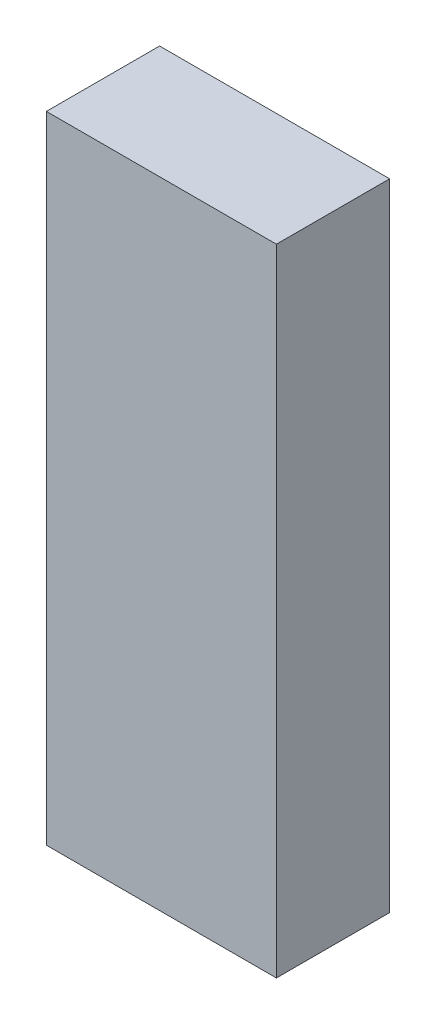
ISO-10303-21;
HEADER;
FILE_DESCRIPTION(('STEP AP214'),'2;1');
FILE_NAME('part.step','',(''),(''),'','','');
FILE_SCHEMA(('AUTOMOTIVE_DESIGN { 1 0 10303 214 1 1 1 1 }'));
ENDSEC;
DATA;
#1=APPLICATION_CONTEXT('core data for automotive mechanical design processes');
#2=APPLICATION_PROTOCOL_DEFINITION('international standard','automotive_design',2000,#1);
#3=PRODUCT_CONTEXT('',#1,'mechanical');
#4=PRODUCT('Part','Part','',(#3));
#5=PRODUCT_RELATED_PRODUCT_CATEGORY('part','',(#4));
#6=PRODUCT_DEFINITION_FORMATION('','',#4);
#7=PRODUCT_DEFINITION_CONTEXT('part definition',#1,'design');
#8=PRODUCT_DEFINITION('design','',#6,#7);
#9=PRODUCT_DEFINITION_SHAPE('','',#8);
#10=(LENGTH_UNIT() NAMED_UNIT(*) SI_UNIT(.MILLI.,.METRE.));
#11=(NAMED_UNIT(*) PLANE_ANGLE_UNIT() SI_UNIT($,.RADIAN.));
#12=(NAMED_UNIT(*) SI_UNIT($,.STERADIAN.) SOLID_ANGLE_UNIT());
#13=UNCERTAINTY_MEASURE_WITH_UNIT(LENGTH_MEASURE(1.E-05),#10,'distance_accuracy_value','');
#14=(GEOMETRIC_REPRESENTATION_CONTEXT(3) GLOBAL_UNCERTAINTY_ASSIGNED_CONTEXT((#13)) GLOBAL_UNIT_ASSIGNED_CONTEXT((#10,
#11,#12)) REPRESENTATION_CONTEXT('',''));
#15=CARTESIAN_POINT('',(0.,0.,0.));
#16=DIRECTION('',(0.,0.,1.));
#17=DIRECTION('',(1.,0.,0.));
#18=AXIS2_PLACEMENT_3D('',#15,#16,#17);
#19=CARTESIAN_POINT('',(-0.32500316,-2.34697778,0.31999936));
#20=DIRECTION('',(0.,0.,-1.));
#21=DIRECTION('',(-1.,0.,0.));
#22=AXIS2_PLACEMENT_3D('',#19,#20,#21);
#23=PLANE('',#22);
#24=DIRECTION('',(1.,0.,0.));
#25=VECTOR('',#24,1.);
#26=CARTESIAN_POINT('',(-0.32500316,-4.1428035,0.31999936));
#27=LINE('',#26,#25);
#28=CARTESIAN_POINT('',(-0.32500316,-4.1428035,0.31999936));
#29=VERTEX_POINT('',#28);
#30=CARTESIAN_POINT('',(0.32499808,-4.1428035,0.31999936));
#31=VERTEX_POINT('',#30);
#32=EDGE_CURVE('E54',#29,#31,#27,.T.);
#33=ORIENTED_EDGE('',*,*,#32,.T.);
#34=DIRECTION('',(0.,1.,0.));
#35=VECTOR('',#34,1.);
#36=CARTESIAN_POINT('',(0.32499808,-4.1428035,0.31999936));
#37=LINE('',#36,#35);
#38=CARTESIAN_POINT('',(0.32499808,-2.34697778,0.31999936));
#39=VERTEX_POINT('',#38);
#40=EDGE_CURVE('E56',#31,#39,#37,.T.);
#41=ORIENTED_EDGE('',*,*,#40,.T.);
#42=DIRECTION('',(1.,0.,0.));
#43=VECTOR('',#42,1.);
#44=CARTESIAN_POINT('',(0.32499808,-2.34697778,0.31999936));
#45=LINE('',#44,#43);
#46=CARTESIAN_POINT('',(-0.32500316,-2.34697778,0.31999936));
#47=VERTEX_POINT('',#46);
#48=EDGE_CURVE('E19',#39,#47,#45,.F.);
#49=ORIENTED_EDGE('',*,*,#48,.T.);
#50=DIRECTION('',(0.,1.,0.));
#51=VECTOR('',#50,1.);
#52=CARTESIAN_POINT('',(-0.32500316,-2.34697778,0.31999936));
#53=LINE('',#52,#51);
#54=EDGE_CURVE('E79',#47,#29,#53,.F.);
#55=ORIENTED_EDGE('',*,*,#54,.T.);
#56=EDGE_LOOP('',(#33,#41,#49,#55));
#57=FACE_BOUND('',#56,.T.);
#58=ADVANCED_FACE('F16',(#57),#23,.F.);
#59=CARTESIAN_POINT('',(0.32499808,-2.34697778,0.));
#60=DIRECTION('',(0.,-1.,0.));
#61=DIRECTION('',(0.,0.,-1.));
#62=AXIS2_PLACEMENT_3D('',#59,#60,#61);
#63=PLANE('',#62);
#64=DIRECTION('',(0.,0.,-1.));
#65=VECTOR('',#64,1.);
#66=CARTESIAN_POINT('',(-0.32500316,-2.34697778,0.));
#67=LINE('',#66,#65);
#68=CARTESIAN_POINT('',(-0.32500316,-2.34697778,0.));
#69=VERTEX_POINT('',#68);
#70=EDGE_CURVE('E67',#69,#47,#67,.F.);
#71=ORIENTED_EDGE('',*,*,#70,.T.);
#72=ORIENTED_EDGE('',*,*,#48,.F.);
#73=DIRECTION('',(0.,0.,1.));
#74=VECTOR('',#73,1.);
#75=CARTESIAN_POINT('',(0.32499808,-2.34697778,0.));
#76=LINE('',#75,#74);
#77=CARTESIAN_POINT('',(0.32499808,-2.34697778,0.));
#78=VERTEX_POINT('',#77);
#79=EDGE_CURVE('E62',#39,#78,#76,.F.);
#80=ORIENTED_EDGE('',*,*,#79,.T.);
#81=DIRECTION('',(-1.,0.,0.));
#82=VECTOR('',#81,1.);
#83=CARTESIAN_POINT('',(-0.32500316,-2.34697778,0.));
#84=LINE('',#83,#82);
#85=EDGE_CURVE('E82',#69,#78,#84,.F.);
#86=ORIENTED_EDGE('',*,*,#85,.F.);
#87=EDGE_LOOP('',(#71,#72,#80,#86));
#88=FACE_BOUND('',#87,.T.);
#89=ADVANCED_FACE('F64',(#88),#63,.F.);
#90=CARTESIAN_POINT('',(0.32499808,-4.1428035,0.));
#91=DIRECTION('',(-1.,0.,0.));
#92=DIRECTION('',(0.,0.,1.));
#93=AXIS2_PLACEMENT_3D('',#90,#91,#92);
#94=PLANE('',#93);
#95=ORIENTED_EDGE('',*,*,#79,.F.);
#96=ORIENTED_EDGE('',*,*,#40,.F.);
#97=DIRECTION('',(0.,0.,1.));
#98=VECTOR('',#97,1.);
#99=CARTESIAN_POINT('',(0.32499808,-4.1428035,0.));
#100=LINE('',#99,#98);
#101=CARTESIAN_POINT('',(0.32499808,-4.1428035,0.));
#102=VERTEX_POINT('',#101);
#103=EDGE_CURVE('E74',#31,#102,#100,.F.);
#104=ORIENTED_EDGE('',*,*,#103,.T.);
#105=DIRECTION('',(0.,1.,0.));
#106=VECTOR('',#105,1.);
#107=CARTESIAN_POINT('',(0.32499808,-2.34697778,0.));
#108=LINE('',#107,#106);
#109=EDGE_CURVE('E71',#78,#102,#108,.F.);
#110=ORIENTED_EDGE('',*,*,#109,.F.);
#111=EDGE_LOOP('',(#95,#96,#104,#110));
#112=FACE_BOUND('',#111,.T.);
#113=ADVANCED_FACE('F69',(#112),#94,.F.);
#114=CARTESIAN_POINT('',(-0.32500316,-4.1428035,0.));
#115=DIRECTION('',(0.,1.,0.));
#116=DIRECTION('',(0.,0.,1.));
#117=AXIS2_PLACEMENT_3D('',#114,#115,#116);
#118=PLANE('',#117);
#119=ORIENTED_EDGE('',*,*,#103,.F.);
#120=ORIENTED_EDGE('',*,*,#32,.F.);
#121=DIRECTION('',(0.,0.,-1.));
#122=VECTOR('',#121,1.);
#123=CARTESIAN_POINT('',(-0.32500316,-4.1428035,0.));
#124=LINE('',#123,#122);
#125=CARTESIAN_POINT('',(-0.32500316,-4.1428035,0.));
#126=VERTEX_POINT('',#125);
#127=EDGE_CURVE('E34',#29,#126,#124,.T.);
#128=ORIENTED_EDGE('',*,*,#127,.T.);
#129=DIRECTION('',(-1.,0.,0.));
#130=VECTOR('',#129,1.);
#131=CARTESIAN_POINT('',(-0.32500316,-4.1428035,0.));
#132=LINE('',#131,#130);
#133=EDGE_CURVE('E25',#102,#126,#132,.T.);
#134=ORIENTED_EDGE('',*,*,#133,.F.);
#135=EDGE_LOOP('',(#119,#120,#128,#134));
#136=FACE_BOUND('',#135,.T.);
#137=ADVANCED_FACE('F88',(#136),#118,.F.);
#138=CARTESIAN_POINT('',(-0.32500316,-2.34697778,0.));
#139=DIRECTION('',(1.,0.,0.));
#140=DIRECTION('',(0.,0.,-1.));
#141=AXIS2_PLACEMENT_3D('',#138,#139,#140);
#142=PLANE('',#141);
#143=ORIENTED_EDGE('',*,*,#127,.F.);
#144=ORIENTED_EDGE('',*,*,#54,.F.);
#145=ORIENTED_EDGE('',*,*,#70,.F.);
#146=DIRECTION('',(0.,1.,0.));
#147=VECTOR('',#146,1.);
#148=CARTESIAN_POINT('',(-0.32500316,-2.34697778,0.));
#149=LINE('',#148,#147);
#150=EDGE_CURVE('E11',#126,#69,#149,.T.);
#151=ORIENTED_EDGE('',*,*,#150,.F.);
#152=EDGE_LOOP('',(#143,#144,#145,#151));
#153=FACE_BOUND('',#152,.T.);
#154=ADVANCED_FACE('F90',(#153),#142,.F.);
#155=CARTESIAN_POINT('',(-0.32500316,-2.34697778,0.));
#156=DIRECTION('',(0.,0.,-1.));
#157=DIRECTION('',(-1.,0.,0.));
#158=AXIS2_PLACEMENT_3D('',#155,#156,#157);
#159=PLANE('',#158);
#160=ORIENTED_EDGE('',*,*,#133,.T.);
#161=ORIENTED_EDGE('',*,*,#150,.T.);
#162=ORIENTED_EDGE('',*,*,#85,.T.);
#163=ORIENTED_EDGE('',*,*,#109,.T.);
#164=EDGE_LOOP('',(#160,#161,#162,#163));
#165=FACE_BOUND('',#164,.T.);
#166=ADVANCED_FACE('F87',(#165),#159,.T.);
#167=CLOSED_SHELL('',(#58,#89,#113,#137,#154,#166));
#168=MANIFOLD_SOLID_BREP('B1',#167);
#169=ADVANCED_BREP_SHAPE_REPRESENTATION('',(#18,#168),#14);
#170=SHAPE_DEFINITION_REPRESENTATION(#9,#169);
ENDSEC;
END-ISO-10303-21;
